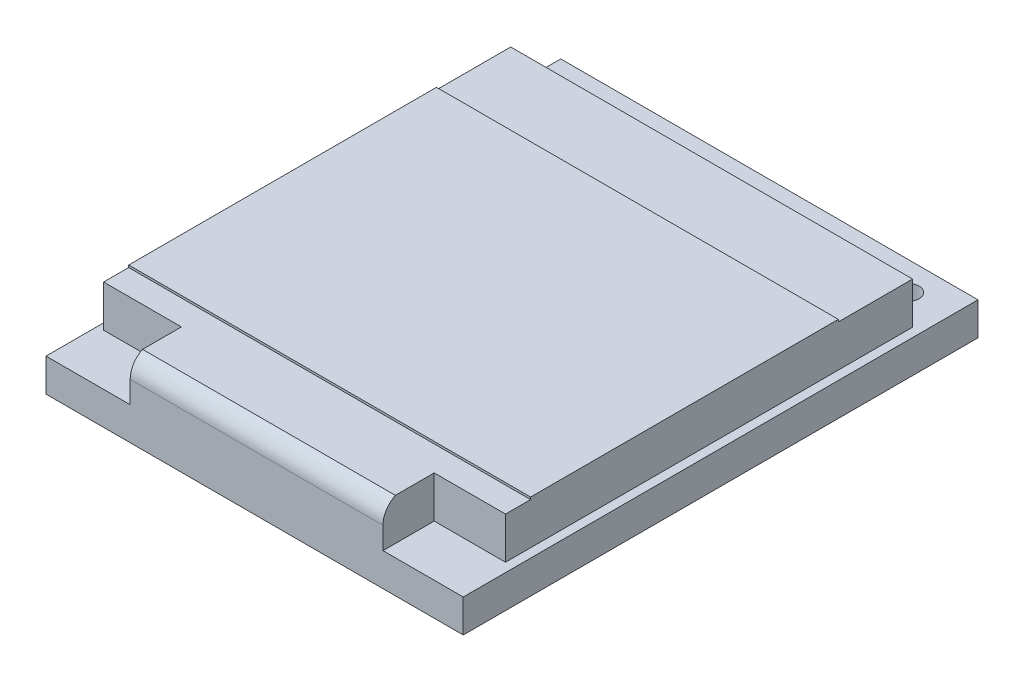
ISO-10303-21;
HEADER;
FILE_DESCRIPTION(('STEP AP214'),'2;1');
FILE_NAME('part.step','',(''),(''),'','','');
FILE_SCHEMA(('AUTOMOTIVE_DESIGN { 1 0 10303 214 1 1 1 1 }'));
ENDSEC;
DATA;
#1=APPLICATION_CONTEXT('core data for automotive mechanical design processes');
#2=APPLICATION_PROTOCOL_DEFINITION('international standard','automotive_design',2000,#1);
#3=PRODUCT_CONTEXT('',#1,'mechanical');
#4=PRODUCT('Part','Part','',(#3));
#5=PRODUCT_RELATED_PRODUCT_CATEGORY('part','',(#4));
#6=PRODUCT_DEFINITION_FORMATION('','',#4);
#7=PRODUCT_DEFINITION_CONTEXT('part definition',#1,'design');
#8=PRODUCT_DEFINITION('design','',#6,#7);
#9=PRODUCT_DEFINITION_SHAPE('','',#8);
#10=(LENGTH_UNIT() NAMED_UNIT(*) SI_UNIT(.MILLI.,.METRE.));
#11=(NAMED_UNIT(*) PLANE_ANGLE_UNIT() SI_UNIT($,.RADIAN.));
#12=(NAMED_UNIT(*) SI_UNIT($,.STERADIAN.) SOLID_ANGLE_UNIT());
#13=UNCERTAINTY_MEASURE_WITH_UNIT(LENGTH_MEASURE(1.E-05),#10,'distance_accuracy_value','');
#14=(GEOMETRIC_REPRESENTATION_CONTEXT(3) GLOBAL_UNCERTAINTY_ASSIGNED_CONTEXT((#13)) GLOBAL_UNIT_ASSIGNED_CONTEXT((#10,
#11,#12)) REPRESENTATION_CONTEXT('',''));
#15=CARTESIAN_POINT('',(0.,0.,0.));
#16=DIRECTION('',(0.,0.,1.));
#17=DIRECTION('',(1.,0.,0.));
#18=AXIS2_PLACEMENT_3D('',#15,#16,#17);
#19=CARTESIAN_POINT('',(0.290127114769082,3.5,2.56916476146928));
#20=DIRECTION('',(0.,0.,1.));
#21=DIRECTION('',(1.,0.,0.));
#22=AXIS2_PLACEMENT_3D('',#19,#20,#21);
#23=PLANE('',#22);
#24=DIRECTION('',(-1.,0.,0.));
#25=VECTOR('',#24,1.);
#26=CARTESIAN_POINT('',(0.290127114769082,3.4,2.56916476146928));
#27=LINE('',#26,#25);
#28=CARTESIAN_POINT('',(18.5917975918305,3.4,2.56916476146928));
#29=VERTEX_POINT('',#28);
#30=CARTESIAN_POINT('',(0.290127114769082,3.4,2.56916476146928));
#31=VERTEX_POINT('',#30);
#32=EDGE_CURVE('E200',#29,#31,#27,.T.);
#33=ORIENTED_EDGE('',*,*,#32,.F.);
#34=DIRECTION('',(0.,-1.,0.));
#35=VECTOR('',#34,1.);
#36=CARTESIAN_POINT('',(18.5917975918305,3.5,2.56916476146928));
#37=LINE('',#36,#35);
#38=CARTESIAN_POINT('',(18.5917975918305,1.5,2.56916476146928));
#39=VERTEX_POINT('',#38);
#40=EDGE_CURVE('E233',#29,#39,#37,.T.);
#41=ORIENTED_EDGE('',*,*,#40,.T.);
#42=DIRECTION('',(-1.,0.,0.));
#43=VECTOR('',#42,1.);
#44=CARTESIAN_POINT('',(0.290127114769082,1.5,2.56916476146928));
#45=LINE('',#44,#43);
#46=CARTESIAN_POINT('',(0.290127114769082,1.5,2.56916476146928));
#47=VERTEX_POINT('',#46);
#48=EDGE_CURVE('E210',#39,#47,#45,.T.);
#49=ORIENTED_EDGE('',*,*,#48,.T.);
#50=DIRECTION('',(0.,-1.,0.));
#51=VECTOR('',#50,1.);
#52=CARTESIAN_POINT('',(0.290127114769082,3.5,2.56916476146928));
#53=LINE('',#52,#51);
#54=EDGE_CURVE('E212',#31,#47,#53,.T.);
#55=ORIENTED_EDGE('',*,*,#54,.F.);
#56=EDGE_LOOP('',(#33,#41,#49,#55));
#57=FACE_BOUND('',#56,.T.);
#58=ADVANCED_FACE('F36',(#57),#23,.F.);
#59=CARTESIAN_POINT('',(0.,1.5,0.));
#60=DIRECTION('',(0.,1.,0.));
#61=DIRECTION('',(0.,0.,1.));
#62=AXIS2_PLACEMENT_3D('',#59,#60,#61);
#63=PLANE('',#62);
#64=DIRECTION('',(0.,0.,-1.));
#65=VECTOR('',#64,1.);
#66=CARTESIAN_POINT('',(15.3447270233196,1.5,21.1069858253315));
#67=LINE('',#66,#65);
#68=CARTESIAN_POINT('',(15.3447270233196,1.5,23.44));
#69=VERTEX_POINT('',#68);
#70=CARTESIAN_POINT('',(15.3447270233196,1.5,21.1069858253315));
#71=VERTEX_POINT('',#70);
#72=EDGE_CURVE('E221',#69,#71,#67,.T.);
#73=ORIENTED_EDGE('',*,*,#72,.F.);
#74=DIRECTION('',(1.,0.,0.));
#75=VECTOR('',#74,1.);
#76=CARTESIAN_POINT('',(0.,1.5,23.44));
#77=LINE('',#76,#75);
#78=CARTESIAN_POINT('',(19.,1.5,23.44));
#79=VERTEX_POINT('',#78);
#80=EDGE_CURVE('E293',#69,#79,#77,.T.);
#81=ORIENTED_EDGE('',*,*,#80,.T.);
#82=DIRECTION('',(0.,0.,-1.));
#83=VECTOR('',#82,1.);
#84=CARTESIAN_POINT('',(19.,1.5,0.));
#85=LINE('',#84,#83);
#86=CARTESIAN_POINT('',(19.,1.5,0.));
#87=VERTEX_POINT('',#86);
#88=EDGE_CURVE('E298',#79,#87,#85,.T.);
#89=ORIENTED_EDGE('',*,*,#88,.T.);
#90=DIRECTION('',(-1.,0.,0.));
#91=VECTOR('',#90,1.);
#92=CARTESIAN_POINT('',(0.,1.5,0.));
#93=LINE('',#92,#91);
#94=CARTESIAN_POINT('',(0.,1.5,0.));
#95=VERTEX_POINT('',#94);
#96=EDGE_CURVE('E300',#87,#95,#93,.T.);
#97=ORIENTED_EDGE('',*,*,#96,.T.);
#98=DIRECTION('',(0.,0.,1.));
#99=VECTOR('',#98,1.);
#100=CARTESIAN_POINT('',(0.,1.5,0.));
#101=LINE('',#100,#99);
#102=CARTESIAN_POINT('',(0.,1.5,23.44));
#103=VERTEX_POINT('',#102);
#104=EDGE_CURVE('E290',#95,#103,#101,.T.);
#105=ORIENTED_EDGE('',*,*,#104,.T.);
#106=CARTESIAN_POINT('',(3.83238591678098,1.5,23.44));
#107=VERTEX_POINT('',#106);
#108=EDGE_CURVE('E295',#103,#107,#77,.T.);
#109=ORIENTED_EDGE('',*,*,#108,.T.);
#110=DIRECTION('',(0.,0.,1.));
#111=VECTOR('',#110,1.);
#112=CARTESIAN_POINT('',(3.83238591678098,1.5,21.1069858253315));
#113=LINE('',#112,#111);
#114=CARTESIAN_POINT('',(3.83238591678098,1.5,21.1069858253315));
#115=VERTEX_POINT('',#114);
#116=EDGE_CURVE('E218',#115,#107,#113,.T.);
#117=ORIENTED_EDGE('',*,*,#116,.F.);
#118=DIRECTION('',(1.,0.,0.));
#119=VECTOR('',#118,1.);
#120=CARTESIAN_POINT('',(0.290127114769082,1.5,21.1069858253315));
#121=LINE('',#120,#119);
#122=CARTESIAN_POINT('',(0.290127114769082,1.5,21.1069858253315));
#123=VERTEX_POINT('',#122);
#124=EDGE_CURVE('E215',#123,#115,#121,.T.);
#125=ORIENTED_EDGE('',*,*,#124,.F.);
#126=DIRECTION('',(0.,0.,1.));
#127=VECTOR('',#126,1.);
#128=CARTESIAN_POINT('',(0.290127114769082,1.5,2.56916476146928));
#129=LINE('',#128,#127);
#130=EDGE_CURVE('E205',#47,#123,#129,.T.);
#131=ORIENTED_EDGE('',*,*,#130,.F.);
#132=ORIENTED_EDGE('',*,*,#48,.F.);
#133=DIRECTION('',(0.,0.,-1.));
#134=VECTOR('',#133,1.);
#135=CARTESIAN_POINT('',(18.5917975918305,1.5,2.56916476146928));
#136=LINE('',#135,#134);
#137=CARTESIAN_POINT('',(18.5917975918305,1.5,21.1069858253315));
#138=VERTEX_POINT('',#137);
#139=EDGE_CURVE('E227',#138,#39,#136,.T.);
#140=ORIENTED_EDGE('',*,*,#139,.F.);
#141=DIRECTION('',(1.,0.,0.));
#142=VECTOR('',#141,1.);
#143=CARTESIAN_POINT('',(15.3447270233196,1.5,21.1069858253315));
#144=LINE('',#143,#142);
#145=EDGE_CURVE('E224',#71,#138,#144,.T.);
#146=ORIENTED_EDGE('',*,*,#145,.F.);
#147=EDGE_LOOP('',(#73,#81,#89,#97,#105,#109,#117,#125,#131,#132,#140,#146));
#148=FACE_BOUND('',#147,.T.);
#149=CARTESIAN_POINT('',(14.58,1.5,1.3));
#150=DIRECTION('',(0.,1.,0.));
#151=DIRECTION('',(0.,0.,1.));
#152=AXIS2_PLACEMENT_3D('',#149,#150,#151);
#153=CIRCLE('',#152,0.500000000000001);
#154=CARTESIAN_POINT('',(14.58,1.5,1.8));
#155=VERTEX_POINT('',#154);
#156=EDGE_CURVE('E254',#155,#155,#153,.T.);
#157=ORIENTED_EDGE('',*,*,#156,.F.);
#158=EDGE_LOOP('',(#157));
#159=FACE_BOUND('',#158,.T.);
#160=CARTESIAN_POINT('',(9.5,1.5,1.3));
#161=DIRECTION('',(0.,1.,0.));
#162=DIRECTION('',(0.,0.,1.));
#163=AXIS2_PLACEMENT_3D('',#160,#161,#162);
#164=CIRCLE('',#163,0.500000000000001);
#165=CARTESIAN_POINT('',(9.5,1.5,1.8));
#166=VERTEX_POINT('',#165);
#167=EDGE_CURVE('E266',#166,#166,#164,.T.);
#168=ORIENTED_EDGE('',*,*,#167,.F.);
#169=EDGE_LOOP('',(#168));
#170=FACE_BOUND('',#169,.T.);
#171=CARTESIAN_POINT('',(4.42,1.5,1.3));
#172=DIRECTION('',(0.,1.,0.));
#173=DIRECTION('',(0.,0.,1.));
#174=AXIS2_PLACEMENT_3D('',#171,#172,#173);
#175=CIRCLE('',#174,0.500000000000001);
#176=CARTESIAN_POINT('',(4.42,1.5,1.8));
#177=VERTEX_POINT('',#176);
#178=EDGE_CURVE('E278',#177,#177,#175,.T.);
#179=ORIENTED_EDGE('',*,*,#178,.F.);
#180=EDGE_LOOP('',(#179));
#181=FACE_BOUND('',#180,.T.);
#182=CARTESIAN_POINT('',(1.88,1.5,1.3));
#183=DIRECTION('',(0.,1.,0.));
#184=DIRECTION('',(0.,0.,1.));
#185=AXIS2_PLACEMENT_3D('',#182,#183,#184);
#186=CIRCLE('',#185,0.499999999999999);
#187=CARTESIAN_POINT('',(1.88,1.5,1.8));
#188=VERTEX_POINT('',#187);
#189=EDGE_CURVE('E284',#188,#188,#186,.T.);
#190=ORIENTED_EDGE('',*,*,#189,.F.);
#191=EDGE_LOOP('',(#190));
#192=FACE_BOUND('',#191,.T.);
#193=CARTESIAN_POINT('',(6.96,1.5,1.3));
#194=DIRECTION('',(0.,1.,0.));
#195=DIRECTION('',(0.,0.,1.));
#196=AXIS2_PLACEMENT_3D('',#193,#194,#195);
#197=CIRCLE('',#196,0.5);
#198=CARTESIAN_POINT('',(6.96,1.5,1.8));
#199=VERTEX_POINT('',#198);
#200=EDGE_CURVE('E272',#199,#199,#197,.T.);
#201=ORIENTED_EDGE('',*,*,#200,.F.);
#202=EDGE_LOOP('',(#201));
#203=FACE_BOUND('',#202,.T.);
#204=CARTESIAN_POINT('',(12.04,1.5,1.3));
#205=DIRECTION('',(0.,1.,0.));
#206=DIRECTION('',(0.,0.,1.));
#207=AXIS2_PLACEMENT_3D('',#204,#205,#206);
#208=CIRCLE('',#207,0.500000000000001);
#209=CARTESIAN_POINT('',(12.04,1.5,1.8));
#210=VERTEX_POINT('',#209);
#211=EDGE_CURVE('E260',#210,#210,#208,.T.);
#212=ORIENTED_EDGE('',*,*,#211,.F.);
#213=EDGE_LOOP('',(#212));
#214=FACE_BOUND('',#213,.T.);
#215=CARTESIAN_POINT('',(17.12,1.5,1.3));
#216=DIRECTION('',(0.,1.,0.));
#217=DIRECTION('',(0.,0.,1.));
#218=AXIS2_PLACEMENT_3D('',#215,#216,#217);
#219=CIRCLE('',#218,0.499999999999999);
#220=CARTESIAN_POINT('',(17.12,1.5,1.8));
#221=VERTEX_POINT('',#220);
#222=EDGE_CURVE('E248',#221,#221,#219,.T.);
#223=ORIENTED_EDGE('',*,*,#222,.F.);
#224=EDGE_LOOP('',(#223));
#225=FACE_BOUND('',#224,.T.);
#226=ADVANCED_FACE('F343',(#148,#159,#170,#181,#192,#203,#214,#225),#63,.T.);
#227=CARTESIAN_POINT('',(0.,0.,0.));
#228=DIRECTION('',(0.,1.,0.));
#229=DIRECTION('',(0.,0.,1.));
#230=AXIS2_PLACEMENT_3D('',#227,#228,#229);
#231=PLANE('',#230);
#232=DIRECTION('',(0.,0.,1.));
#233=VECTOR('',#232,1.);
#234=CARTESIAN_POINT('',(0.,0.,0.));
#235=LINE('',#234,#233);
#236=CARTESIAN_POINT('',(0.,0.,0.));
#237=VERTEX_POINT('',#236);
#238=CARTESIAN_POINT('',(0.,0.,23.44));
#239=VERTEX_POINT('',#238);
#240=EDGE_CURVE('E287',#237,#239,#235,.T.);
#241=ORIENTED_EDGE('',*,*,#240,.F.);
#242=DIRECTION('',(-1.,0.,0.));
#243=VECTOR('',#242,1.);
#244=CARTESIAN_POINT('',(0.,0.,0.));
#245=LINE('',#244,#243);
#246=CARTESIAN_POINT('',(19.,0.,0.));
#247=VERTEX_POINT('',#246);
#248=EDGE_CURVE('E294',#247,#237,#245,.T.);
#249=ORIENTED_EDGE('',*,*,#248,.F.);
#250=DIRECTION('',(0.,0.,-1.));
#251=VECTOR('',#250,1.);
#252=CARTESIAN_POINT('',(19.,0.,0.));
#253=LINE('',#252,#251);
#254=CARTESIAN_POINT('',(19.,0.,23.44));
#255=VERTEX_POINT('',#254);
#256=EDGE_CURVE('E307',#255,#247,#253,.T.);
#257=ORIENTED_EDGE('',*,*,#256,.F.);
#258=DIRECTION('',(1.,0.,0.));
#259=VECTOR('',#258,1.);
#260=CARTESIAN_POINT('',(0.,0.,23.44));
#261=LINE('',#260,#259);
#262=EDGE_CURVE('E305',#239,#255,#261,.T.);
#263=ORIENTED_EDGE('',*,*,#262,.F.);
#264=EDGE_LOOP('',(#241,#249,#257,#263));
#265=FACE_BOUND('',#264,.T.);
#266=CARTESIAN_POINT('',(1.88,0.,1.3));
#267=DIRECTION('',(0.,1.,0.));
#268=DIRECTION('',(0.,0.,1.));
#269=AXIS2_PLACEMENT_3D('',#266,#267,#268);
#270=CIRCLE('',#269,0.499999999999999);
#271=CARTESIAN_POINT('',(1.88,0.,1.8));
#272=VERTEX_POINT('',#271);
#273=EDGE_CURVE('E281',#272,#272,#270,.T.);
#274=ORIENTED_EDGE('',*,*,#273,.T.);
#275=EDGE_LOOP('',(#274));
#276=FACE_BOUND('',#275,.T.);
#277=CARTESIAN_POINT('',(4.42,0.,1.3));
#278=DIRECTION('',(0.,1.,0.));
#279=DIRECTION('',(0.,0.,1.));
#280=AXIS2_PLACEMENT_3D('',#277,#278,#279);
#281=CIRCLE('',#280,0.500000000000001);
#282=CARTESIAN_POINT('',(4.42,0.,1.8));
#283=VERTEX_POINT('',#282);
#284=EDGE_CURVE('E275',#283,#283,#281,.T.);
#285=ORIENTED_EDGE('',*,*,#284,.T.);
#286=EDGE_LOOP('',(#285));
#287=FACE_BOUND('',#286,.T.);
#288=CARTESIAN_POINT('',(6.96,0.,1.3));
#289=DIRECTION('',(0.,1.,0.));
#290=DIRECTION('',(0.,0.,1.));
#291=AXIS2_PLACEMENT_3D('',#288,#289,#290);
#292=CIRCLE('',#291,0.5);
#293=CARTESIAN_POINT('',(6.96,0.,1.8));
#294=VERTEX_POINT('',#293);
#295=EDGE_CURVE('E269',#294,#294,#292,.T.);
#296=ORIENTED_EDGE('',*,*,#295,.T.);
#297=EDGE_LOOP('',(#296));
#298=FACE_BOUND('',#297,.T.);
#299=CARTESIAN_POINT('',(9.5,0.,1.3));
#300=DIRECTION('',(0.,1.,0.));
#301=DIRECTION('',(0.,0.,1.));
#302=AXIS2_PLACEMENT_3D('',#299,#300,#301);
#303=CIRCLE('',#302,0.500000000000001);
#304=CARTESIAN_POINT('',(9.5,0.,1.8));
#305=VERTEX_POINT('',#304);
#306=EDGE_CURVE('E263',#305,#305,#303,.T.);
#307=ORIENTED_EDGE('',*,*,#306,.T.);
#308=EDGE_LOOP('',(#307));
#309=FACE_BOUND('',#308,.T.);
#310=CARTESIAN_POINT('',(12.04,0.,1.3));
#311=DIRECTION('',(0.,1.,0.));
#312=DIRECTION('',(0.,0.,1.));
#313=AXIS2_PLACEMENT_3D('',#310,#311,#312);
#314=CIRCLE('',#313,0.500000000000001);
#315=CARTESIAN_POINT('',(12.04,0.,1.8));
#316=VERTEX_POINT('',#315);
#317=EDGE_CURVE('E257',#316,#316,#314,.T.);
#318=ORIENTED_EDGE('',*,*,#317,.T.);
#319=EDGE_LOOP('',(#318));
#320=FACE_BOUND('',#319,.T.);
#321=CARTESIAN_POINT('',(14.58,0.,1.3));
#322=DIRECTION('',(0.,1.,0.));
#323=DIRECTION('',(0.,0.,1.));
#324=AXIS2_PLACEMENT_3D('',#321,#322,#323);
#325=CIRCLE('',#324,0.500000000000001);
#326=CARTESIAN_POINT('',(14.58,0.,1.8));
#327=VERTEX_POINT('',#326);
#328=EDGE_CURVE('E251',#327,#327,#325,.T.);
#329=ORIENTED_EDGE('',*,*,#328,.T.);
#330=EDGE_LOOP('',(#329));
#331=FACE_BOUND('',#330,.T.);
#332=CARTESIAN_POINT('',(17.12,0.,1.3));
#333=DIRECTION('',(0.,1.,0.));
#334=DIRECTION('',(0.,0.,1.));
#335=AXIS2_PLACEMENT_3D('',#332,#333,#334);
#336=CIRCLE('',#335,0.499999999999999);
#337=CARTESIAN_POINT('',(17.12,0.,1.8));
#338=VERTEX_POINT('',#337);
#339=EDGE_CURVE('E247',#338,#338,#336,.T.);
#340=ORIENTED_EDGE('',*,*,#339,.T.);
#341=EDGE_LOOP('',(#340));
#342=FACE_BOUND('',#341,.T.);
#343=ADVANCED_FACE('F375',(#265,#276,#287,#298,#309,#320,#331,#342),#231,.F.);
#344=CARTESIAN_POINT('',(0.,1.5,0.));
#345=DIRECTION('',(1.,0.,0.));
#346=DIRECTION('',(0.,0.,-1.));
#347=AXIS2_PLACEMENT_3D('',#344,#345,#346);
#348=PLANE('',#347);
#349=ORIENTED_EDGE('',*,*,#240,.T.);
#350=DIRECTION('',(0.,-1.,0.));
#351=VECTOR('',#350,1.);
#352=CARTESIAN_POINT('',(0.,1.5,23.44));
#353=LINE('',#352,#351);
#354=EDGE_CURVE('E318',#103,#239,#353,.T.);
#355=ORIENTED_EDGE('',*,*,#354,.F.);
#356=ORIENTED_EDGE('',*,*,#104,.F.);
#357=DIRECTION('',(0.,-1.,0.));
#358=VECTOR('',#357,1.);
#359=CARTESIAN_POINT('',(0.,1.5,0.));
#360=LINE('',#359,#358);
#361=EDGE_CURVE('E302',#95,#237,#360,.T.);
#362=ORIENTED_EDGE('',*,*,#361,.T.);
#363=EDGE_LOOP('',(#349,#355,#356,#362));
#364=FACE_BOUND('',#363,.T.);
#365=ADVANCED_FACE('F423',(#364),#348,.F.);
#366=CARTESIAN_POINT('',(0.,1.5,23.44));
#367=DIRECTION('',(0.,0.,-1.));
#368=DIRECTION('',(-1.,0.,0.));
#369=AXIS2_PLACEMENT_3D('',#366,#367,#368);
#370=PLANE('',#369);
#371=DIRECTION('',(0.,-1.,0.));
#372=VECTOR('',#371,1.);
#373=CARTESIAN_POINT('',(15.3447270233196,3.5,23.44));
#374=LINE('',#373,#372);
#375=CARTESIAN_POINT('',(15.3447270233196,2.5,23.44));
#376=VERTEX_POINT('',#375);
#377=EDGE_CURVE('E239',#376,#69,#374,.T.);
#378=ORIENTED_EDGE('',*,*,#377,.F.);
#379=DIRECTION('',(1.,0.,0.));
#380=VECTOR('',#379,1.);
#381=CARTESIAN_POINT('',(3.83238591678098,2.5,23.44));
#382=LINE('',#381,#380);
#383=CARTESIAN_POINT('',(3.83238591678098,2.5,23.44));
#384=VERTEX_POINT('',#383);
#385=EDGE_CURVE('E323',#376,#384,#382,.F.);
#386=ORIENTED_EDGE('',*,*,#385,.T.);
#387=DIRECTION('',(0.,-1.,0.));
#388=VECTOR('',#387,1.);
#389=CARTESIAN_POINT('',(3.83238591678098,3.5,23.44));
#390=LINE('',#389,#388);
#391=EDGE_CURVE('E241',#384,#107,#390,.T.);
#392=ORIENTED_EDGE('',*,*,#391,.T.);
#393=ORIENTED_EDGE('',*,*,#108,.F.);
#394=ORIENTED_EDGE('',*,*,#354,.T.);
#395=ORIENTED_EDGE('',*,*,#262,.T.);
#396=DIRECTION('',(0.,-1.,0.));
#397=VECTOR('',#396,1.);
#398=CARTESIAN_POINT('',(19.,1.5,23.44));
#399=LINE('',#398,#397);
#400=EDGE_CURVE('E315',#79,#255,#399,.T.);
#401=ORIENTED_EDGE('',*,*,#400,.F.);
#402=ORIENTED_EDGE('',*,*,#80,.F.);
#403=EDGE_LOOP('',(#378,#386,#392,#393,#394,#395,#401,#402));
#404=FACE_BOUND('',#403,.T.);
#405=ADVANCED_FACE('F431',(#404),#370,.F.);
#406=CARTESIAN_POINT('',(19.,1.5,0.));
#407=DIRECTION('',(-1.,0.,0.));
#408=DIRECTION('',(0.,0.,1.));
#409=AXIS2_PLACEMENT_3D('',#406,#407,#408);
#410=PLANE('',#409);
#411=ORIENTED_EDGE('',*,*,#256,.T.);
#412=DIRECTION('',(0.,-1.,0.));
#413=VECTOR('',#412,1.);
#414=CARTESIAN_POINT('',(19.,1.5,0.));
#415=LINE('',#414,#413);
#416=EDGE_CURVE('E312',#87,#247,#415,.T.);
#417=ORIENTED_EDGE('',*,*,#416,.F.);
#418=ORIENTED_EDGE('',*,*,#88,.F.);
#419=ORIENTED_EDGE('',*,*,#400,.T.);
#420=EDGE_LOOP('',(#411,#417,#418,#419));
#421=FACE_BOUND('',#420,.T.);
#422=ADVANCED_FACE('F427',(#421),#410,.F.);
#423=CARTESIAN_POINT('',(0.,1.5,0.));
#424=DIRECTION('',(0.,0.,1.));
#425=DIRECTION('',(1.,0.,0.));
#426=AXIS2_PLACEMENT_3D('',#423,#424,#425);
#427=PLANE('',#426);
#428=ORIENTED_EDGE('',*,*,#248,.T.);
#429=ORIENTED_EDGE('',*,*,#361,.F.);
#430=ORIENTED_EDGE('',*,*,#96,.F.);
#431=ORIENTED_EDGE('',*,*,#416,.T.);
#432=EDGE_LOOP('',(#428,#429,#430,#431));
#433=FACE_BOUND('',#432,.T.);
#434=ADVANCED_FACE('F418',(#433),#427,.F.);
#435=CARTESIAN_POINT('',(1.88,1.5,1.3));
#436=DIRECTION('',(0.,-1.,0.));
#437=DIRECTION('',(0.,0.,-1.));
#438=AXIS2_PLACEMENT_3D('',#435,#436,#437);
#439=CYLINDRICAL_SURFACE('',#438,0.499999999999999);
#440=ORIENTED_EDGE('',*,*,#189,.T.);
#441=EDGE_LOOP('',(#440));
#442=FACE_BOUND('',#441,.T.);
#443=ORIENTED_EDGE('',*,*,#273,.F.);
#444=EDGE_LOOP('',(#443));
#445=FACE_BOUND('',#444,.T.);
#446=ADVANCED_FACE('F415',(#442,#445),#439,.F.);
#447=CARTESIAN_POINT('',(4.42,1.5,1.3));
#448=DIRECTION('',(0.,-1.,0.));
#449=DIRECTION('',(0.,0.,-1.));
#450=AXIS2_PLACEMENT_3D('',#447,#448,#449);
#451=CYLINDRICAL_SURFACE('',#450,0.500000000000001);
#452=ORIENTED_EDGE('',*,*,#178,.T.);
#453=EDGE_LOOP('',(#452));
#454=FACE_BOUND('',#453,.T.);
#455=ORIENTED_EDGE('',*,*,#284,.F.);
#456=EDGE_LOOP('',(#455));
#457=FACE_BOUND('',#456,.T.);
#458=ADVANCED_FACE('F411',(#454,#457),#451,.F.);
#459=CARTESIAN_POINT('',(6.96,1.5,1.3));
#460=DIRECTION('',(0.,-1.,0.));
#461=DIRECTION('',(0.,0.,-1.));
#462=AXIS2_PLACEMENT_3D('',#459,#460,#461);
#463=CYLINDRICAL_SURFACE('',#462,0.5);
#464=ORIENTED_EDGE('',*,*,#200,.T.);
#465=EDGE_LOOP('',(#464));
#466=FACE_BOUND('',#465,.T.);
#467=ORIENTED_EDGE('',*,*,#295,.F.);
#468=EDGE_LOOP('',(#467));
#469=FACE_BOUND('',#468,.T.);
#470=ADVANCED_FACE('F407',(#466,#469),#463,.F.);
#471=CARTESIAN_POINT('',(9.5,1.5,1.3));
#472=DIRECTION('',(0.,-1.,0.));
#473=DIRECTION('',(0.,0.,-1.));
#474=AXIS2_PLACEMENT_3D('',#471,#472,#473);
#475=CYLINDRICAL_SURFACE('',#474,0.500000000000001);
#476=ORIENTED_EDGE('',*,*,#167,.T.);
#477=EDGE_LOOP('',(#476));
#478=FACE_BOUND('',#477,.T.);
#479=ORIENTED_EDGE('',*,*,#306,.F.);
#480=EDGE_LOOP('',(#479));
#481=FACE_BOUND('',#480,.T.);
#482=ADVANCED_FACE('F403',(#478,#481),#475,.F.);
#483=CARTESIAN_POINT('',(12.04,1.5,1.3));
#484=DIRECTION('',(0.,-1.,0.));
#485=DIRECTION('',(0.,0.,-1.));
#486=AXIS2_PLACEMENT_3D('',#483,#484,#485);
#487=CYLINDRICAL_SURFACE('',#486,0.500000000000001);
#488=ORIENTED_EDGE('',*,*,#211,.T.);
#489=EDGE_LOOP('',(#488));
#490=FACE_BOUND('',#489,.T.);
#491=ORIENTED_EDGE('',*,*,#317,.F.);
#492=EDGE_LOOP('',(#491));
#493=FACE_BOUND('',#492,.T.);
#494=ADVANCED_FACE('F399',(#490,#493),#487,.F.);
#495=CARTESIAN_POINT('',(14.58,1.5,1.3));
#496=DIRECTION('',(0.,-1.,0.));
#497=DIRECTION('',(0.,0.,-1.));
#498=AXIS2_PLACEMENT_3D('',#495,#496,#497);
#499=CYLINDRICAL_SURFACE('',#498,0.500000000000001);
#500=ORIENTED_EDGE('',*,*,#156,.T.);
#501=EDGE_LOOP('',(#500));
#502=FACE_BOUND('',#501,.T.);
#503=ORIENTED_EDGE('',*,*,#328,.F.);
#504=EDGE_LOOP('',(#503));
#505=FACE_BOUND('',#504,.T.);
#506=ADVANCED_FACE('F395',(#502,#505),#499,.F.);
#507=CARTESIAN_POINT('',(17.12,1.5,1.3));
#508=DIRECTION('',(0.,-1.,0.));
#509=DIRECTION('',(0.,0.,-1.));
#510=AXIS2_PLACEMENT_3D('',#507,#508,#509);
#511=CYLINDRICAL_SURFACE('',#510,0.499999999999999);
#512=ORIENTED_EDGE('',*,*,#222,.T.);
#513=EDGE_LOOP('',(#512));
#514=FACE_BOUND('',#513,.T.);
#515=ORIENTED_EDGE('',*,*,#339,.F.);
#516=EDGE_LOOP('',(#515));
#517=FACE_BOUND('',#516,.T.);
#518=ADVANCED_FACE('F392',(#514,#517),#511,.F.);
#519=CARTESIAN_POINT('',(0.290127114769082,3.5,2.56916476146928));
#520=DIRECTION('',(1.,0.,0.));
#521=DIRECTION('',(0.,0.,-1.));
#522=AXIS2_PLACEMENT_3D('',#519,#520,#521);
#523=PLANE('',#522);
#524=DIRECTION('',(0.,0.,1.));
#525=VECTOR('',#524,1.);
#526=CARTESIAN_POINT('',(0.290127114769082,3.4,19.9644916456382));
#527=LINE('',#526,#525);
#528=CARTESIAN_POINT('',(0.290127114769082,3.4,19.9644916456382));
#529=VERTEX_POINT('',#528);
#530=CARTESIAN_POINT('',(0.290127114769081,3.4,21.1069858253315));
#531=VERTEX_POINT('',#530);
#532=EDGE_CURVE('E172',#529,#531,#527,.T.);
#533=ORIENTED_EDGE('',*,*,#532,.F.);
#534=DIRECTION('',(0.,1.,0.));
#535=VECTOR('',#534,1.);
#536=CARTESIAN_POINT('',(0.290127114769082,3.4,19.9644916456382));
#537=LINE('',#536,#535);
#538=CARTESIAN_POINT('',(0.290127114769082,3.5,19.9644916456382));
#539=VERTEX_POINT('',#538);
#540=EDGE_CURVE('E171',#529,#539,#537,.T.);
#541=ORIENTED_EDGE('',*,*,#540,.T.);
#542=DIRECTION('',(0.,0.,1.));
#543=VECTOR('',#542,1.);
#544=CARTESIAN_POINT('',(0.290127114769082,3.5,2.56916476146928));
#545=LINE('',#544,#543);
#546=CARTESIAN_POINT('',(0.290127114769082,3.5,5.9497940252366));
#547=VERTEX_POINT('',#546);
#548=EDGE_CURVE('E207',#547,#539,#545,.T.);
#549=ORIENTED_EDGE('',*,*,#548,.F.);
#550=DIRECTION('',(0.,1.,0.));
#551=VECTOR('',#550,1.);
#552=CARTESIAN_POINT('',(0.290127114769082,3.4,5.9497940252366));
#553=LINE('',#552,#551);
#554=CARTESIAN_POINT('',(0.290127114769082,3.4,5.9497940252366));
#555=VERTEX_POINT('',#554);
#556=EDGE_CURVE('E58',#555,#547,#553,.T.);
#557=ORIENTED_EDGE('',*,*,#556,.F.);
#558=DIRECTION('',(0.,0.,1.));
#559=VECTOR('',#558,1.);
#560=CARTESIAN_POINT('',(0.290127114769082,3.4,2.56916476146928));
#561=LINE('',#560,#559);
#562=EDGE_CURVE('E192',#31,#555,#561,.T.);
#563=ORIENTED_EDGE('',*,*,#562,.F.);
#564=ORIENTED_EDGE('',*,*,#54,.T.);
#565=ORIENTED_EDGE('',*,*,#130,.T.);
#566=DIRECTION('',(0.,-1.,0.));
#567=VECTOR('',#566,1.);
#568=CARTESIAN_POINT('',(0.290127114769082,3.5,21.1069858253315));
#569=LINE('',#568,#567);
#570=EDGE_CURVE('E245',#531,#123,#569,.T.);
#571=ORIENTED_EDGE('',*,*,#570,.F.);
#572=EDGE_LOOP('',(#533,#541,#549,#557,#563,#564,#565,#571));
#573=FACE_BOUND('',#572,.T.);
#574=ADVANCED_FACE('F357',(#573),#523,.F.);
#575=CARTESIAN_POINT('',(0.290127114769082,3.5,21.1069858253315));
#576=DIRECTION('',(0.,0.,-1.));
#577=DIRECTION('',(-1.,0.,0.));
#578=AXIS2_PLACEMENT_3D('',#575,#576,#577);
#579=PLANE('',#578);
#580=DIRECTION('',(0.,-1.,0.));
#581=VECTOR('',#580,1.);
#582=CARTESIAN_POINT('',(3.83238591678098,3.5,21.1069858253315));
#583=LINE('',#582,#581);
#584=CARTESIAN_POINT('',(3.83238591678098,3.4,21.1069858253315));
#585=VERTEX_POINT('',#584);
#586=EDGE_CURVE('E243',#585,#115,#583,.T.);
#587=ORIENTED_EDGE('',*,*,#586,.F.);
#588=DIRECTION('',(-1.,0.,0.));
#589=VECTOR('',#588,1.);
#590=CARTESIAN_POINT('',(0.290127114769082,3.4,21.1069858253315));
#591=LINE('',#590,#589);
#592=EDGE_CURVE('E187',#585,#531,#591,.T.);
#593=ORIENTED_EDGE('',*,*,#592,.T.);
#594=ORIENTED_EDGE('',*,*,#570,.T.);
#595=ORIENTED_EDGE('',*,*,#124,.T.);
#596=EDGE_LOOP('',(#587,#593,#594,#595));
#597=FACE_BOUND('',#596,.T.);
#598=ADVANCED_FACE('F386',(#597),#579,.F.);
#599=CARTESIAN_POINT('',(3.83238591678098,3.5,21.1069858253315));
#600=DIRECTION('',(1.,0.,0.));
#601=DIRECTION('',(0.,0.,-1.));
#602=AXIS2_PLACEMENT_3D('',#599,#600,#601);
#603=PLANE('',#602);
#604=CARTESIAN_POINT('',(3.83238591678098,2.5,22.44));
#605=DIRECTION('',(1.,0.,0.));
#606=DIRECTION('',(0.,0.,-1.));
#607=AXIS2_PLACEMENT_3D('',#604,#605,#606);
#608=CIRCLE('',#607,1.);
#609=CARTESIAN_POINT('',(3.83238591678098,3.4,22.8758898943541));
#610=VERTEX_POINT('',#609);
#611=EDGE_CURVE('E44',#384,#610,#608,.F.);
#612=ORIENTED_EDGE('',*,*,#611,.T.);
#613=DIRECTION('',(0.,0.,-1.));
#614=VECTOR('',#613,1.);
#615=CARTESIAN_POINT('',(3.83238591678098,3.4,21.1069858253315));
#616=LINE('',#615,#614);
#617=EDGE_CURVE('E50',#610,#585,#616,.T.);
#618=ORIENTED_EDGE('',*,*,#617,.T.);
#619=ORIENTED_EDGE('',*,*,#586,.T.);
#620=ORIENTED_EDGE('',*,*,#116,.T.);
#621=ORIENTED_EDGE('',*,*,#391,.F.);
#622=EDGE_LOOP('',(#612,#618,#619,#620,#621));
#623=FACE_BOUND('',#622,.T.);
#624=ADVANCED_FACE('F328',(#623),#603,.F.);
#625=CARTESIAN_POINT('',(15.3447270233196,3.5,21.1069858253315));
#626=DIRECTION('',(-1.,0.,0.));
#627=DIRECTION('',(0.,0.,1.));
#628=AXIS2_PLACEMENT_3D('',#625,#626,#627);
#629=PLANE('',#628);
#630=DIRECTION('',(0.,-1.,0.));
#631=VECTOR('',#630,1.);
#632=CARTESIAN_POINT('',(15.3447270233196,3.5,21.1069858253315));
#633=LINE('',#632,#631);
#634=CARTESIAN_POINT('',(15.3447270233196,3.4,21.1069858253315));
#635=VERTEX_POINT('',#634);
#636=EDGE_CURVE('E237',#635,#71,#633,.T.);
#637=ORIENTED_EDGE('',*,*,#636,.F.);
#638=DIRECTION('',(0.,0.,1.));
#639=VECTOR('',#638,1.);
#640=CARTESIAN_POINT('',(15.3447270233196,3.4,21.1069858253315));
#641=LINE('',#640,#639);
#642=CARTESIAN_POINT('',(15.3447270233196,3.4,22.8758898943541));
#643=VERTEX_POINT('',#642);
#644=EDGE_CURVE('E179',#635,#643,#641,.T.);
#645=ORIENTED_EDGE('',*,*,#644,.T.);
#646=CARTESIAN_POINT('',(15.3447270233196,2.5,22.44));
#647=DIRECTION('',(-1.,0.,0.));
#648=DIRECTION('',(0.,0.,1.));
#649=AXIS2_PLACEMENT_3D('',#646,#647,#648);
#650=CIRCLE('',#649,1.);
#651=EDGE_CURVE('E321',#643,#376,#650,.F.);
#652=ORIENTED_EDGE('',*,*,#651,.T.);
#653=ORIENTED_EDGE('',*,*,#377,.T.);
#654=ORIENTED_EDGE('',*,*,#72,.T.);
#655=EDGE_LOOP('',(#637,#645,#652,#653,#654));
#656=FACE_BOUND('',#655,.T.);
#657=ADVANCED_FACE('F335',(#656),#629,.F.);
#658=CARTESIAN_POINT('',(15.3447270233196,3.5,21.1069858253315));
#659=DIRECTION('',(0.,0.,-1.));
#660=DIRECTION('',(-1.,0.,0.));
#661=AXIS2_PLACEMENT_3D('',#658,#659,#660);
#662=PLANE('',#661);
#663=DIRECTION('',(0.,-1.,0.));
#664=VECTOR('',#663,1.);
#665=CARTESIAN_POINT('',(18.5917975918305,3.5,21.1069858253315));
#666=LINE('',#665,#664);
#667=CARTESIAN_POINT('',(18.5917975918305,3.4,21.1069858253315));
#668=VERTEX_POINT('',#667);
#669=EDGE_CURVE('E235',#668,#138,#666,.T.);
#670=ORIENTED_EDGE('',*,*,#669,.F.);
#671=DIRECTION('',(-1.,0.,0.));
#672=VECTOR('',#671,1.);
#673=CARTESIAN_POINT('',(15.3447270233196,3.4,21.1069858253315));
#674=LINE('',#673,#672);
#675=EDGE_CURVE('E160',#668,#635,#674,.T.);
#676=ORIENTED_EDGE('',*,*,#675,.T.);
#677=ORIENTED_EDGE('',*,*,#636,.T.);
#678=ORIENTED_EDGE('',*,*,#145,.T.);
#679=EDGE_LOOP('',(#670,#676,#677,#678));
#680=FACE_BOUND('',#679,.T.);
#681=ADVANCED_FACE('F340',(#680),#662,.F.);
#682=CARTESIAN_POINT('',(18.5917975918305,3.5,2.56916476146928));
#683=DIRECTION('',(-1.,0.,0.));
#684=DIRECTION('',(0.,0.,1.));
#685=AXIS2_PLACEMENT_3D('',#682,#683,#684);
#686=PLANE('',#685);
#687=DIRECTION('',(0.,0.,-1.));
#688=VECTOR('',#687,1.);
#689=CARTESIAN_POINT('',(18.5917975918305,3.5,2.56916476146928));
#690=LINE('',#689,#688);
#691=CARTESIAN_POINT('',(18.5917975918305,3.5,19.9644916456382));
#692=VERTEX_POINT('',#691);
#693=CARTESIAN_POINT('',(18.5917975918305,3.5,5.9497940252366));
#694=VERTEX_POINT('',#693);
#695=EDGE_CURVE('E177',#692,#694,#690,.T.);
#696=ORIENTED_EDGE('',*,*,#695,.F.);
#697=DIRECTION('',(0.,1.,0.));
#698=VECTOR('',#697,1.);
#699=CARTESIAN_POINT('',(18.5917975918305,3.4,19.9644916456382));
#700=LINE('',#699,#698);
#701=CARTESIAN_POINT('',(18.5917975918305,3.4,19.9644916456382));
#702=VERTEX_POINT('',#701);
#703=EDGE_CURVE('E168',#702,#692,#700,.T.);
#704=ORIENTED_EDGE('',*,*,#703,.F.);
#705=DIRECTION('',(0.,0.,-1.));
#706=VECTOR('',#705,1.);
#707=CARTESIAN_POINT('',(18.5917975918305,3.4,19.9644916456382));
#708=LINE('',#707,#706);
#709=EDGE_CURVE('E154',#668,#702,#708,.T.);
#710=ORIENTED_EDGE('',*,*,#709,.F.);
#711=ORIENTED_EDGE('',*,*,#669,.T.);
#712=ORIENTED_EDGE('',*,*,#139,.T.);
#713=ORIENTED_EDGE('',*,*,#40,.F.);
#714=DIRECTION('',(0.,0.,-1.));
#715=VECTOR('',#714,1.);
#716=CARTESIAN_POINT('',(18.5917975918305,3.4,2.56916476146928));
#717=LINE('',#716,#715);
#718=CARTESIAN_POINT('',(18.5917975918305,3.4,5.9497940252366));
#719=VERTEX_POINT('',#718);
#720=EDGE_CURVE('E198',#719,#29,#717,.T.);
#721=ORIENTED_EDGE('',*,*,#720,.F.);
#722=DIRECTION('',(0.,1.,0.));
#723=VECTOR('',#722,1.);
#724=CARTESIAN_POINT('',(18.5917975918305,3.4,5.9497940252366));
#725=LINE('',#724,#723);
#726=EDGE_CURVE('E203',#719,#694,#725,.T.);
#727=ORIENTED_EDGE('',*,*,#726,.T.);
#728=EDGE_LOOP('',(#696,#704,#710,#711,#712,#713,#721,#727));
#729=FACE_BOUND('',#728,.T.);
#730=ADVANCED_FACE('F175',(#729),#686,.F.);
#731=CARTESIAN_POINT('',(0.,3.5,0.));
#732=DIRECTION('',(0.,1.,0.));
#733=DIRECTION('',(0.,0.,1.));
#734=AXIS2_PLACEMENT_3D('',#731,#732,#733);
#735=PLANE('',#734);
#736=DIRECTION('',(-1.,0.,0.));
#737=VECTOR('',#736,1.);
#738=CARTESIAN_POINT('',(18.5917975918305,3.5,19.9644916456382));
#739=LINE('',#738,#737);
#740=EDGE_CURVE('E164',#692,#539,#739,.T.);
#741=ORIENTED_EDGE('',*,*,#740,.F.);
#742=ORIENTED_EDGE('',*,*,#695,.T.);
#743=DIRECTION('',(1.,0.,0.));
#744=VECTOR('',#743,1.);
#745=CARTESIAN_POINT('',(0.290127114769082,3.5,5.9497940252366));
#746=LINE('',#745,#744);
#747=EDGE_CURVE('E191',#547,#694,#746,.T.);
#748=ORIENTED_EDGE('',*,*,#747,.F.);
#749=ORIENTED_EDGE('',*,*,#548,.T.);
#750=EDGE_LOOP('',(#741,#742,#748,#749));
#751=FACE_BOUND('',#750,.T.);
#752=ADVANCED_FACE('F360',(#751),#735,.T.);
#753=CARTESIAN_POINT('',(0.,2.5,22.44));
#754=DIRECTION('',(-1.,0.,0.));
#755=DIRECTION('',(0.,0.,1.));
#756=AXIS2_PLACEMENT_3D('',#753,#754,#755);
#757=CYLINDRICAL_SURFACE('',#756,1.);
#758=DIRECTION('',(-1.,0.,0.));
#759=VECTOR('',#758,1.);
#760=CARTESIAN_POINT('',(0.,3.4,22.8758898943541));
#761=LINE('',#760,#759);
#762=EDGE_CURVE('E11',#610,#643,#761,.F.);
#763=ORIENTED_EDGE('',*,*,#762,.F.);
#764=ORIENTED_EDGE('',*,*,#611,.F.);
#765=ORIENTED_EDGE('',*,*,#385,.F.);
#766=ORIENTED_EDGE('',*,*,#651,.F.);
#767=EDGE_LOOP('',(#763,#764,#765,#766));
#768=FACE_BOUND('',#767,.T.);
#769=ADVANCED_FACE('F38',(#768),#757,.T.);
#770=CARTESIAN_POINT('',(0.290127114769082,3.4,5.9497940252366));
#771=DIRECTION('',(0.,0.,1.));
#772=DIRECTION('',(1.,0.,0.));
#773=AXIS2_PLACEMENT_3D('',#770,#771,#772);
#774=PLANE('',#773);
#775=ORIENTED_EDGE('',*,*,#747,.T.);
#776=ORIENTED_EDGE('',*,*,#726,.F.);
#777=DIRECTION('',(1.,0.,0.));
#778=VECTOR('',#777,1.);
#779=CARTESIAN_POINT('',(0.290127114769082,3.4,5.9497940252366));
#780=LINE('',#779,#778);
#781=EDGE_CURVE('E195',#555,#719,#780,.T.);
#782=ORIENTED_EDGE('',*,*,#781,.F.);
#783=ORIENTED_EDGE('',*,*,#556,.T.);
#784=EDGE_LOOP('',(#775,#776,#782,#783));
#785=FACE_BOUND('',#784,.T.);
#786=ADVANCED_FACE('F361',(#785),#774,.F.);
#787=CARTESIAN_POINT('',(0.,3.4,0.));
#788=DIRECTION('',(0.,1.,0.));
#789=DIRECTION('',(0.,0.,1.));
#790=AXIS2_PLACEMENT_3D('',#787,#788,#789);
#791=PLANE('',#790);
#792=ORIENTED_EDGE('',*,*,#562,.T.);
#793=ORIENTED_EDGE('',*,*,#781,.T.);
#794=ORIENTED_EDGE('',*,*,#720,.T.);
#795=ORIENTED_EDGE('',*,*,#32,.T.);
#796=EDGE_LOOP('',(#792,#793,#794,#795));
#797=FACE_BOUND('',#796,.T.);
#798=ADVANCED_FACE('F355',(#797),#791,.T.);
#799=CARTESIAN_POINT('',(0.,3.4,0.));
#800=DIRECTION('',(0.,-1.,0.));
#801=DIRECTION('',(0.,0.,-1.));
#802=AXIS2_PLACEMENT_3D('',#799,#800,#801);
#803=PLANE('',#802);
#804=ORIENTED_EDGE('',*,*,#709,.T.);
#805=DIRECTION('',(-1.,0.,0.));
#806=VECTOR('',#805,1.);
#807=CARTESIAN_POINT('',(18.5917975918305,3.4,19.9644916456382));
#808=LINE('',#807,#806);
#809=EDGE_CURVE('E157',#702,#529,#808,.T.);
#810=ORIENTED_EDGE('',*,*,#809,.T.);
#811=ORIENTED_EDGE('',*,*,#532,.T.);
#812=ORIENTED_EDGE('',*,*,#592,.F.);
#813=ORIENTED_EDGE('',*,*,#617,.F.);
#814=ORIENTED_EDGE('',*,*,#762,.T.);
#815=ORIENTED_EDGE('',*,*,#644,.F.);
#816=ORIENTED_EDGE('',*,*,#675,.F.);
#817=EDGE_LOOP('',(#804,#810,#811,#812,#813,#814,#815,#816));
#818=FACE_BOUND('',#817,.T.);
#819=ADVANCED_FACE('F156',(#818),#803,.F.);
#820=CARTESIAN_POINT('',(18.5917975918305,3.4,19.9644916456382));
#821=DIRECTION('',(0.,0.,-1.));
#822=DIRECTION('',(-1.,0.,0.));
#823=AXIS2_PLACEMENT_3D('',#820,#821,#822);
#824=PLANE('',#823);
#825=ORIENTED_EDGE('',*,*,#740,.T.);
#826=ORIENTED_EDGE('',*,*,#540,.F.);
#827=ORIENTED_EDGE('',*,*,#809,.F.);
#828=ORIENTED_EDGE('',*,*,#703,.T.);
#829=EDGE_LOOP('',(#825,#826,#827,#828));
#830=FACE_BOUND('',#829,.T.);
#831=ADVANCED_FACE('F167',(#830),#824,.F.);
#832=CLOSED_SHELL('',(#58,#226,#343,#365,#405,#422,#434,#446,#458,#470,#482,#494,#506,#518,#574,
#598,#624,#657,#681,#730,#752,#769,#786,#798,#819,#831));
#833=MANIFOLD_SOLID_BREP('B2',#832);
#834=ADVANCED_BREP_SHAPE_REPRESENTATION('',(#18,#833),#14);
#835=SHAPE_DEFINITION_REPRESENTATION(#9,#834);
ENDSEC;
END-ISO-10303-21;
